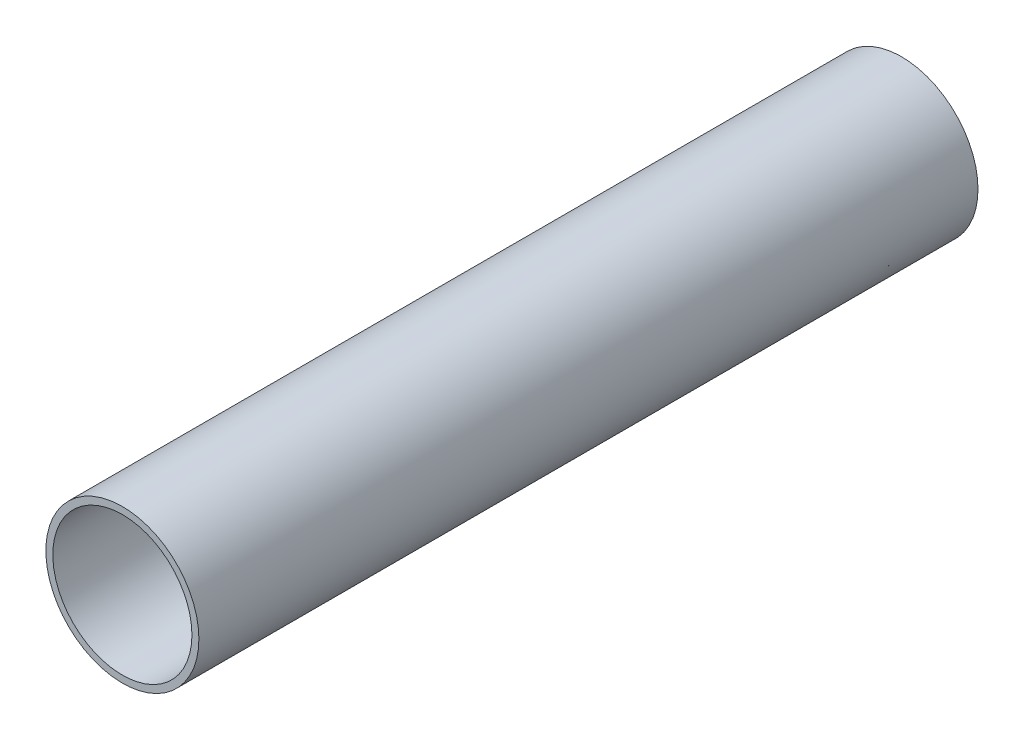
ISO-10303-21;
HEADER;
FILE_DESCRIPTION(('STEP AP214'),'2;1');
FILE_NAME('part.step','',(''),(''),'','','');
FILE_SCHEMA(('AUTOMOTIVE_DESIGN { 1 0 10303 214 1 1 1 1 }'));
ENDSEC;
DATA;
#1=APPLICATION_CONTEXT('core data for automotive mechanical design processes');
#2=APPLICATION_PROTOCOL_DEFINITION('international standard','automotive_design',2000,#1);
#3=PRODUCT_CONTEXT('',#1,'mechanical');
#4=PRODUCT('Part','Part','',(#3));
#5=PRODUCT_RELATED_PRODUCT_CATEGORY('part','',(#4));
#6=PRODUCT_DEFINITION_FORMATION('','',#4);
#7=PRODUCT_DEFINITION_CONTEXT('part definition',#1,'design');
#8=PRODUCT_DEFINITION('design','',#6,#7);
#9=PRODUCT_DEFINITION_SHAPE('','',#8);
#10=(LENGTH_UNIT() NAMED_UNIT(*) SI_UNIT(.MILLI.,.METRE.));
#11=(NAMED_UNIT(*) PLANE_ANGLE_UNIT() SI_UNIT($,.RADIAN.));
#12=(NAMED_UNIT(*) SI_UNIT($,.STERADIAN.) SOLID_ANGLE_UNIT());
#13=UNCERTAINTY_MEASURE_WITH_UNIT(LENGTH_MEASURE(1.E-05),#10,'distance_accuracy_value','');
#14=(GEOMETRIC_REPRESENTATION_CONTEXT(3) GLOBAL_UNCERTAINTY_ASSIGNED_CONTEXT((#13)) GLOBAL_UNIT_ASSIGNED_CONTEXT((#10,
#11,#12)) REPRESENTATION_CONTEXT('',''));
#15=CARTESIAN_POINT('',(0.,0.,0.));
#16=DIRECTION('',(0.,0.,1.));
#17=DIRECTION('',(1.,0.,0.));
#18=AXIS2_PLACEMENT_3D('',#15,#16,#17);
#19=CARTESIAN_POINT('',(0.,0.,28.));
#20=DIRECTION('',(0.,0.,1.));
#21=DIRECTION('',(1.,0.,0.));
#22=AXIS2_PLACEMENT_3D('',#19,#20,#21);
#23=PLANE('',#22);
#24=CARTESIAN_POINT('',(0.,0.,28.));
#25=DIRECTION('',(0.,0.,1.));
#26=DIRECTION('',(1.,0.,0.));
#27=AXIS2_PLACEMENT_3D('',#24,#25,#26);
#28=CIRCLE('',#27,5.5);
#29=CARTESIAN_POINT('',(5.5,0.,28.));
#30=VERTEX_POINT('',#29);
#31=EDGE_CURVE('E79',#30,#30,#28,.T.);
#32=ORIENTED_EDGE('',*,*,#31,.T.);
#33=EDGE_LOOP('',(#32));
#34=FACE_BOUND('',#33,.T.);
#35=CARTESIAN_POINT('',(0.,0.,28.));
#36=DIRECTION('',(0.,0.,1.));
#37=DIRECTION('',(1.,0.,0.));
#38=AXIS2_PLACEMENT_3D('',#35,#36,#37);
#39=CIRCLE('',#38,5.);
#40=CARTESIAN_POINT('',(5.,0.,28.));
#41=VERTEX_POINT('',#40);
#42=EDGE_CURVE('E69',#41,#41,#39,.T.);
#43=ORIENTED_EDGE('',*,*,#42,.F.);
#44=EDGE_LOOP('',(#43));
#45=FACE_BOUND('',#44,.T.);
#46=ADVANCED_FACE('F44',(#34,#45),#23,.T.);
#47=CARTESIAN_POINT('',(0.,0.,-28.));
#48=DIRECTION('',(0.,0.,1.));
#49=DIRECTION('',(1.,0.,0.));
#50=AXIS2_PLACEMENT_3D('',#47,#48,#49);
#51=PLANE('',#50);
#52=CARTESIAN_POINT('',(0.,0.,-28.));
#53=DIRECTION('',(0.,0.,1.));
#54=DIRECTION('',(1.,0.,0.));
#55=AXIS2_PLACEMENT_3D('',#52,#53,#54);
#56=CIRCLE('',#55,5.5);
#57=CARTESIAN_POINT('',(5.5,0.,-28.));
#58=VERTEX_POINT('',#57);
#59=EDGE_CURVE('E82',#58,#58,#56,.T.);
#60=ORIENTED_EDGE('',*,*,#59,.F.);
#61=EDGE_LOOP('',(#60));
#62=FACE_BOUND('',#61,.T.);
#63=CARTESIAN_POINT('',(0.,0.,-28.));
#64=DIRECTION('',(0.,0.,1.));
#65=DIRECTION('',(1.,0.,0.));
#66=AXIS2_PLACEMENT_3D('',#63,#64,#65);
#67=CIRCLE('',#66,5.);
#68=CARTESIAN_POINT('',(0.,5.,-28.));
#69=VERTEX_POINT('',#68);
#70=CARTESIAN_POINT('',(0.,-5.,-28.));
#71=VERTEX_POINT('',#70);
#72=EDGE_CURVE('E63',#69,#71,#67,.T.);
#73=ORIENTED_EDGE('',*,*,#72,.T.);
#74=EDGE_CURVE('E68',#71,#69,#67,.T.);
#75=ORIENTED_EDGE('',*,*,#74,.T.);
#76=EDGE_LOOP('',(#73,#75));
#77=FACE_BOUND('',#76,.T.);
#78=ADVANCED_FACE('F67',(#62,#77),#51,.F.);
#79=CARTESIAN_POINT('',(0.,0.,28.));
#80=DIRECTION('',(0.,0.,-1.));
#81=DIRECTION('',(-1.,0.,0.));
#82=AXIS2_PLACEMENT_3D('',#79,#80,#81);
#83=CYLINDRICAL_SURFACE('',#82,5.5);
#84=ORIENTED_EDGE('',*,*,#31,.F.);
#85=EDGE_LOOP('',(#84));
#86=FACE_BOUND('',#85,.T.);
#87=ORIENTED_EDGE('',*,*,#59,.T.);
#88=EDGE_LOOP('',(#87));
#89=FACE_BOUND('',#88,.T.);
#90=ADVANCED_FACE('F46',(#86,#89),#83,.T.);
#91=CARTESIAN_POINT('',(0.,0.,28.));
#92=DIRECTION('',(0.,0.,-1.));
#93=DIRECTION('',(-1.,0.,0.));
#94=AXIS2_PLACEMENT_3D('',#91,#92,#93);
#95=CYLINDRICAL_SURFACE('',#94,5.);
#96=CARTESIAN_POINT('',(0.,-5.,20.5));
#97=CARTESIAN_POINT('',(0.055576906791677,-4.99999897580871,20.4999979555017));
#98=CARTESIAN_POINT('',(0.11117966019961,-4.99906385178234,20.4953511570325));
#99=CARTESIAN_POINT('',(0.220813507685275,-4.99542365623247,20.4769014998856));
#100=CARTESIAN_POINT('',(0.274843317536735,-4.99271717860211,20.4630913671998));
#101=CARTESIAN_POINT('',(0.379730305257039,-4.98583649278334,20.4267587263817));
#102=CARTESIAN_POINT('',(0.430590467926088,-4.98166369076778,20.4042445631586));
#103=CARTESIAN_POINT('',(0.527807988855865,-4.97230398035402,20.3511677524938));
#104=CARTESIAN_POINT('',(0.574165615066911,-4.9671171323581,20.320605584399));
#105=CARTESIAN_POINT('',(0.661693477305396,-4.95622165330096,20.2518615057168));
#106=CARTESIAN_POINT('',(0.702793951149001,-4.95050745504483,20.2135916446181));
#107=CARTESIAN_POINT('',(0.778036756598671,-4.93924180452736,20.1307075836198));
#108=CARTESIAN_POINT('',(0.812178544761286,-4.93369036500574,20.0860928886775));
#109=CARTESIAN_POINT('',(0.872831753339674,-4.92332441812757,19.9912838070023));
#110=CARTESIAN_POINT('',(0.899270938858775,-4.91851707365076,19.9410423562181));
#111=CARTESIAN_POINT('',(0.943305666574963,-4.91026268058521,19.8367181810109));
#112=CARTESIAN_POINT('',(0.960902082432783,-4.90681549762049,19.7826358366688));
#113=CARTESIAN_POINT('',(0.986525299882335,-4.90172805252255,19.6729156361066));
#114=CARTESIAN_POINT('',(0.994674497957217,-4.90006470107219,19.6173074558715));
#115=CARTESIAN_POINT('',(1.00155212772611,-4.89866375060627,19.5054901786475));
#116=CARTESIAN_POINT('',(1.00028152271411,-4.89892595467828,19.4492811436907));
#117=CARTESIAN_POINT('',(0.988454573103269,-4.90132551148155,19.3387532119874));
#118=CARTESIAN_POINT('',(0.978038540245526,-4.90343452858731,19.2844185943797));
#119=CARTESIAN_POINT('',(0.948437884624575,-4.90924546159972,19.1782839233413));
#120=CARTESIAN_POINT('',(0.92925284310194,-4.91294745357755,19.1264839910839));
#121=CARTESIAN_POINT('',(0.882524783675131,-4.92155618500401,19.026484738297));
#122=CARTESIAN_POINT('',(0.854926151231974,-4.92647089813707,18.9783121204305));
#123=CARTESIAN_POINT('',(0.792193574571142,-4.93694618773087,18.8872291500251));
#124=CARTESIAN_POINT('',(0.757058764354448,-4.94250683838403,18.844319403146));
#125=CARTESIAN_POINT('',(0.679499934556729,-4.95377021241515,18.7641705975395));
#126=CARTESIAN_POINT('',(0.636956161208037,-4.95947369210962,18.7270474321372));
#127=CARTESIAN_POINT('',(0.546185024056451,-4.9702884871447,18.6604461536951));
#128=CARTESIAN_POINT('',(0.497957587373233,-4.97539979489036,18.6309681387029));
#129=CARTESIAN_POINT('',(0.397059386872352,-4.98446690160939,18.5804724907712));
#130=CARTESIAN_POINT('',(0.344381819578984,-4.98842088848315,18.5594681063532));
#131=CARTESIAN_POINT('',(0.236148976442955,-4.99471408987885,18.5266395259601));
#132=CARTESIAN_POINT('',(0.180594050067095,-4.9970535000055,18.5148142179254));
#133=CARTESIAN_POINT('',(0.069179405623226,-4.99982671866872,18.5008435462055));
#134=CARTESIAN_POINT('',(0.0133403283227408,-5.0002917465247,18.4985395804597));
#135=CARTESIAN_POINT('',(-0.0979249341933693,-4.999350519301,18.5032498589423));
#136=CARTESIAN_POINT('',(-0.153351142443357,-4.99794436941446,18.5102635793526));
#137=CARTESIAN_POINT('',(-0.261705659943856,-4.9934383200803,18.5332783735433));
#138=CARTESIAN_POINT('',(-0.314651948336066,-4.9903537640423,18.5491980684967));
#139=CARTESIAN_POINT('',(-0.417123627493724,-4.98283552061081,18.5894839826532));
#140=CARTESIAN_POINT('',(-0.466648761630642,-4.97840173214291,18.6138508346733));
#141=CARTESIAN_POINT('',(-0.561541173677942,-4.96859911533387,18.6706824906458));
#142=CARTESIAN_POINT('',(-0.606850126743466,-4.96321950437158,18.7032427810324));
#143=CARTESIAN_POINT('',(-0.691418019109883,-4.95214734830012,18.7754091911985));
#144=CARTESIAN_POINT('',(-0.730676308921283,-4.94645476968528,18.8150160663898));
#145=CARTESIAN_POINT('',(-0.80264059076518,-4.93529303557112,18.9008733518791));
#146=CARTESIAN_POINT('',(-0.83523770244021,-4.92982860233448,18.9472157442086));
#147=CARTESIAN_POINT('',(-0.892185420044018,-4.91984191796325,19.0448113613426));
#148=CARTESIAN_POINT('',(-0.91653635591642,-4.91531962913464,19.0960643895589));
#149=CARTESIAN_POINT('',(-0.956151841577343,-4.90776740584473,19.2017682461346));
#150=CARTESIAN_POINT('',(-0.971463499787446,-4.90472974872258,19.2562008411958));
#151=CARTESIAN_POINT('',(-0.992708651625426,-4.90047436792061,19.3669334534774));
#152=CARTESIAN_POINT('',(-0.998643368224163,-4.89925640691131,19.4232332261965));
#153=CARTESIAN_POINT('',(-1.00092091086792,-4.8987914963137,19.5350088645334));
#154=CARTESIAN_POINT('',(-0.99743578807184,-4.89950919189282,19.5904811489174));
#155=CARTESIAN_POINT('',(-0.981352304101556,-4.90275573484584,19.700031649898));
#156=CARTESIAN_POINT('',(-0.968754016130856,-4.90528456767138,19.7541098776892));
#157=CARTESIAN_POINT('',(-0.934878568500219,-4.91185264219135,19.8592277112375));
#158=CARTESIAN_POINT('',(-0.913622506718257,-4.91588821018814,19.9102743605006));
#159=CARTESIAN_POINT('',(-0.863054644601445,-4.92501714974173,20.0081037207348));
#160=CARTESIAN_POINT('',(-0.833742168774004,-4.93011060998909,20.0548860737266));
#161=CARTESIAN_POINT('',(-0.767305914784078,-4.94088960523262,20.1437155721532));
#162=CARTESIAN_POINT('',(-0.73005788723217,-4.94658372909745,20.1856687652709));
#163=CARTESIAN_POINT('',(-0.649064369008643,-4.95786081872014,20.2627862055331));
#164=CARTESIAN_POINT('',(-0.605317387148024,-4.9634437586325,20.2979488903214));
#165=CARTESIAN_POINT('',(-0.512017629081917,-4.97393832388037,20.3608346439502));
#166=CARTESIAN_POINT('',(-0.462408884423381,-4.97884231219306,20.3884760032834));
#167=CARTESIAN_POINT('',(-0.359166360934104,-4.98735125085048,20.4349861225991));
#168=CARTESIAN_POINT('',(-0.305536260856448,-4.99095737138657,20.4538627895346));
#169=CARTESIAN_POINT('',(-0.20982148891813,-4.99576372595393,20.4786519480459));
#170=CARTESIAN_POINT('',(-0.16828166400923,-4.99734303158466,20.4866431937085));
#171=CARTESIAN_POINT('',(-0.0844995252077601,-4.99946154139896,20.4973179123585));
#172=CARTESIAN_POINT('',(-0.0422572337474654,-5.00000077873155,20.5000015545098));
#173=CARTESIAN_POINT('',(0.,-5.,20.5));
#174=B_SPLINE_CURVE_WITH_KNOTS('',3,(#96,#97,#98,#99,#100,#101,#102,#103,#104,#105,#106,#107,
#108,#109,#110,#111,#112,#113,#114,#115,#116,#117,#118,#119,#120,#121,#122,#123,#124,#125,#126,
#127,#128,#129,#130,#131,#132,#133,#134,#135,#136,#137,#138,#139,#140,#141,#142,#143,#144,#145,
#146,#147,#148,#149,#150,#151,#152,#153,#154,#155,#156,#157,#158,#159,#160,#161,#162,#163,#164,
#165,#166,#167,#168,#169,#170,#171,#172,#173),.UNSPECIFIED.,.T.,.F.,(4,2,2,2,2,2,2,2,2,2,2,2,2,
2,2,2,2,2,2,2,2,2,2,2,2,2,2,2,2,2,2,2,2,2,2,2,2,2,4),(0.,0.166576130658399,0.333284650685602,
0.499833735241564,0.666372902219031,0.834932670098119,1.00350559673107,1.17361195004325,
1.34370149363633,1.51156185102314,1.67940504280243,1.84471727005694,2.01003739253544,
2.17647490203741,2.34293154750153,2.51238252491971,2.68183567540576,2.85155274854652,
3.02124925698535,3.1881073567644,3.35495607657718,3.52030453950199,3.68566539215124,
3.85305066032172,4.02045388344454,4.19040628577675,4.36035188721842,4.52940381031303,
4.69843368329199,4.86439722566865,5.03035943492152,5.19591961253029,5.36149367582162,
5.52988076239664,5.69830654533676,5.86849496676356,6.03852955518209,6.1651877529024,
6.29184191370997),.UNSPECIFIED.);
#175=CARTESIAN_POINT('',(0.,-5.,20.5));
#176=VERTEX_POINT('',#175);
#177=EDGE_CURVE('E13',#176,#176,#174,.T.);
#178=ORIENTED_EDGE('',*,*,#177,.F.);
#179=EDGE_LOOP('',(#178));
#180=FACE_BOUND('',#179,.T.);
#181=CARTESIAN_POINT('',(0.,5.,20.5));
#182=CARTESIAN_POINT('',(-0.0555769067935894,4.99999897580871,20.4999979555017));
#183=CARTESIAN_POINT('',(-0.111179660203435,4.99906385178228,20.4953511570322));
#184=CARTESIAN_POINT('',(-0.220813507692764,4.99542365623216,20.476901499884));
#185=CARTESIAN_POINT('',(-0.274843317545977,4.99271717860162,20.4630913671972));
#186=CARTESIAN_POINT('',(-0.379730305269587,4.9858364927824,20.4267587263767));
#187=CARTESIAN_POINT('',(-0.430590467940182,4.98166369076658,20.404244563152));
#188=CARTESIAN_POINT('',(-0.527807988872589,4.97230398035226,20.3511677524836));
#189=CARTESIAN_POINT('',(-0.574165615084716,4.96711713235604,20.3206055843866));
#190=CARTESIAN_POINT('',(-0.661693477324337,4.95622165329844,20.2518615057003));
#191=CARTESIAN_POINT('',(-0.70279395116805,4.95050745504212,20.2135916445995));
#192=CARTESIAN_POINT('',(-0.778036756617388,4.93924180452441,20.1307075835968));
#193=CARTESIAN_POINT('',(-0.812178544779566,4.93369036500273,20.0860928886523));
#194=CARTESIAN_POINT('',(-0.87283175335557,4.92332441812474,19.991283806974));
#195=CARTESIAN_POINT('',(-0.899270938872962,4.91851707364816,19.9410423561892));
#196=CARTESIAN_POINT('',(-0.943305666585658,4.91026268058315,19.8367181809809));
#197=CARTESIAN_POINT('',(-0.960902082441697,4.90681549761874,19.7826358366385));
#198=CARTESIAN_POINT('',(-0.986525299887324,4.90172805252154,19.6729156360775));
#199=CARTESIAN_POINT('',(-0.994674497960343,4.90006470107156,19.6173074558441));
#200=CARTESIAN_POINT('',(-1.00155212772614,4.89866375060627,19.5054901786238));
#201=CARTESIAN_POINT('',(-1.0002815227129,4.89892595467853,19.449281143669));
#202=CARTESIAN_POINT('',(-0.988454573100374,4.90132551148214,19.3387532119706));
#203=CARTESIAN_POINT('',(-0.978038540242291,4.90343452858796,19.2844185943657));
#204=CARTESIAN_POINT('',(-0.948437884621532,4.9092454616003,19.1782839233327));
#205=CARTESIAN_POINT('',(-0.929252843099428,4.91294745357802,19.1264839910781));
#206=CARTESIAN_POINT('',(-0.882524783674314,4.92155618500415,19.0264847382958));
#207=CARTESIAN_POINT('',(-0.854926151232259,4.92647089813701,18.9783121204312));
#208=CARTESIAN_POINT('',(-0.79219357457422,4.93694618773037,18.8872291500293));
#209=CARTESIAN_POINT('',(-0.757058764359215,4.94250683838329,18.8443194031517));
#210=CARTESIAN_POINT('',(-0.679499934564445,4.95377021241408,18.7641705975467));
#211=CARTESIAN_POINT('',(-0.636956161216858,4.95947369210848,18.7270474321445));
#212=CARTESIAN_POINT('',(-0.546185024067574,4.97028848714347,18.6604461537024));
#213=CARTESIAN_POINT('',(-0.49795758738555,4.97539979488911,18.63096813871));
#214=CARTESIAN_POINT('',(-0.397059386885495,4.98446690160835,18.5804724907768));
#215=CARTESIAN_POINT('',(-0.344381819591621,4.98842088848229,18.5594681063578));
#216=CARTESIAN_POINT('',(-0.236148976454378,4.99471408987832,18.5266395259628));
#217=CARTESIAN_POINT('',(-0.180594050077807,4.99705350000512,18.5148142179273));
#218=CARTESIAN_POINT('',(-0.0691794056310762,4.99982671866863,18.5008435462059));
#219=CARTESIAN_POINT('',(-0.013340328328413,5.0002917465247,18.4985395804597));
#220=CARTESIAN_POINT('',(0.0979249341920574,4.99935051930105,18.5032498589421));
#221=CARTESIAN_POINT('',(0.153351142444227,4.99794436941446,18.5102635793526));
#222=CARTESIAN_POINT('',(0.261705659949225,4.99343832008005,18.5332783735446));
#223=CARTESIAN_POINT('',(0.31465194834374,4.99035376404183,18.5491980684991));
#224=CARTESIAN_POINT('',(0.417123627505611,4.98283552060984,18.5894839826585));
#225=CARTESIAN_POINT('',(0.466648761644438,4.97840173214163,18.6138508346804));
#226=CARTESIAN_POINT('',(0.561541173694494,4.96859911533201,18.6706824906568));
#227=CARTESIAN_POINT('',(0.606850126760911,4.96321950436945,18.7032427810455));
#228=CARTESIAN_POINT('',(0.691418019128532,4.95214734829752,18.7754091912161));
#229=CARTESIAN_POINT('',(0.730676308940243,4.94645476968248,18.8150160664099));
#230=CARTESIAN_POINT('',(0.802640590783174,4.93529303556818,18.9008733519031));
#231=CARTESIAN_POINT('',(0.835237702457102,4.92982860233161,18.9472157442341));
#232=CARTESIAN_POINT('',(0.892185420058397,4.91984191796063,19.0448113613707));
#233=CARTESIAN_POINT('',(0.916536355929389,4.91531962913221,19.0960643895882));
#234=CARTESIAN_POINT('',(0.956151841586583,4.90776740584292,19.2017682461645));
#235=CARTESIAN_POINT('',(0.97146349979466,4.90472974872115,19.2562008412248));
#236=CARTESIAN_POINT('',(0.992708651628971,4.90047436791989,19.3669334535044));
#237=CARTESIAN_POINT('',(0.998643368226066,4.89925640691092,19.4232332262222));
#238=CARTESIAN_POINT('',(1.00092091086702,4.89879149631388,19.5350088645553));
#239=CARTESIAN_POINT('',(0.997435788069957,4.8995091918932,19.5904811489366));
#240=CARTESIAN_POINT('',(0.981352304098571,4.90275573484644,19.700031649912));
#241=CARTESIAN_POINT('',(0.968754016127747,4.905284567672,19.7541098777005));
#242=CARTESIAN_POINT('',(0.934878568497695,4.91185264219183,19.8592277112436));
#243=CARTESIAN_POINT('',(0.913622506716436,4.91588821018847,19.9102743605043));
#244=CARTESIAN_POINT('',(0.863054644601768,4.92501714974167,20.008103720734));
#245=CARTESIAN_POINT('',(0.833742168775767,4.93011060998878,20.0548860737237));
#246=CARTESIAN_POINT('',(0.767305914788757,4.94088960523189,20.1437155721475));
#247=CARTESIAN_POINT('',(0.730057887238196,4.94658372909654,20.1856687652643));
#248=CARTESIAN_POINT('',(0.649064369017643,4.95786081871895,20.2627862055253));
#249=CARTESIAN_POINT('',(0.605317387158651,4.96344375863119,20.2979488903132));
#250=CARTESIAN_POINT('',(0.512017629094579,4.97393832387906,20.3608346439427));
#251=CARTESIAN_POINT('',(0.462408884436291,4.97884231219186,20.3884760032767));
#252=CARTESIAN_POINT('',(0.359166360947363,4.98735125084952,20.434986122594));
#253=CARTESIAN_POINT('',(0.305536260869807,4.99095737138575,20.4538627895304));
#254=CARTESIAN_POINT('',(0.209821488929432,4.99576372595348,20.4786519480436));
#255=CARTESIAN_POINT('',(0.168281664018341,4.99734303158437,20.486643193707));
#256=CARTESIAN_POINT('',(0.0844995252123744,4.9994615413989,20.4973179123582));
#257=CARTESIAN_POINT('',(0.042257233749773,5.00000077873155,20.5000015545098));
#258=CARTESIAN_POINT('',(0.,5.,20.5));
#259=B_SPLINE_CURVE_WITH_KNOTS('',3,(#181,#182,#183,#184,#185,#186,#187,#188,#189,#190,#191,
#192,#193,#194,#195,#196,#197,#198,#199,#200,#201,#202,#203,#204,#205,#206,#207,#208,#209,#210,
#211,#212,#213,#214,#215,#216,#217,#218,#219,#220,#221,#222,#223,#224,#225,#226,#227,#228,#229,
#230,#231,#232,#233,#234,#235,#236,#237,#238,#239,#240,#241,#242,#243,#244,#245,#246,#247,#248,
#249,#250,#251,#252,#253,#254,#255,#256,#257,#258),.UNSPECIFIED.,.T.,.F.,(4,2,2,2,2,2,2,2,2,2,2,
2,2,2,2,2,2,2,2,2,2,2,2,2,2,2,2,2,2,2,2,2,2,2,2,2,2,2,4),(0.,0.166576130664118,
0.333284650697046,0.499833735259121,0.666372902242699,0.834932670126257,1.00350559676366,
1.17361195007521,1.34370149366763,1.51156185104862,1.67940504282208,1.84471727006863,
2.01003739253916,2.17647490203445,2.34293154749189,2.51238252490732,2.68183567539065,
2.85155274853397,3.02124925697538,3.18810735676092,3.35495607658019,3.52030453951249,
3.68566539216922,3.85305066034547,4.02045388347407,4.19040628580778,4.36035188725093,
4.52940381034146,4.69843368331633,4.8643972256854,5.03035943493068,5.19591961253193,
5.36149367581574,5.52988076238625,5.69830654532188,5.86849496674921,6.03852955516831,
6.16518775289551,6.29184191370999),.UNSPECIFIED.);
#260=CARTESIAN_POINT('',(0.,5.,20.5));
#261=VERTEX_POINT('',#260);
#262=EDGE_CURVE('E56',#261,#261,#259,.T.);
#263=ORIENTED_EDGE('',*,*,#262,.F.);
#264=EDGE_LOOP('',(#263));
#265=FACE_BOUND('',#264,.T.);
#266=ORIENTED_EDGE('',*,*,#42,.T.);
#267=EDGE_LOOP('',(#266));
#268=FACE_BOUND('',#267,.T.);
#269=ORIENTED_EDGE('',*,*,#74,.F.);
#270=CARTESIAN_POINT('',(0.,-5.,-26.));
#271=CARTESIAN_POINT('',(-0.055576906791677,-4.99999897580871,-26.0000020444983));
#272=CARTESIAN_POINT('',(-0.11117966019961,-4.99906385178234,-26.0046488429675));
#273=CARTESIAN_POINT('',(-0.220813507685274,-4.99542365623247,-26.0230985001144));
#274=CARTESIAN_POINT('',(-0.274843317536735,-4.99271717860211,-26.0369086328002));
#275=CARTESIAN_POINT('',(-0.37973030525704,-4.98583649278334,-26.0732412736183));
#276=CARTESIAN_POINT('',(-0.430590467926088,-4.98166369076778,-26.0957554368414));
#277=CARTESIAN_POINT('',(-0.527807988855865,-4.97230398035402,-26.1488322475062));
#278=CARTESIAN_POINT('',(-0.57416561506691,-4.9671171323581,-26.179394415601));
#279=CARTESIAN_POINT('',(-0.661693477305395,-4.95622165330096,-26.2481384942832));
#280=CARTESIAN_POINT('',(-0.702793951149,-4.95050745504483,-26.2864083553819));
#281=CARTESIAN_POINT('',(-0.77803675659867,-4.93924180452736,-26.3692924163802));
#282=CARTESIAN_POINT('',(-0.812178544761286,-4.93369036500574,-26.4139071113225));
#283=CARTESIAN_POINT('',(-0.872831753339674,-4.92332441812757,-26.5087161929977));
#284=CARTESIAN_POINT('',(-0.899270938858774,-4.91851707365076,-26.5589576437819));
#285=CARTESIAN_POINT('',(-0.943305666574962,-4.91026268058521,-26.6632818189891));
#286=CARTESIAN_POINT('',(-0.960902082432782,-4.90681549762049,-26.7173641633312));
#287=CARTESIAN_POINT('',(-0.986525299882334,-4.90172805252255,-26.8270843638934));
#288=CARTESIAN_POINT('',(-0.994674497957216,-4.90006470107219,-26.8826925441285));
#289=CARTESIAN_POINT('',(-1.00155212772611,-4.89866375060627,-26.9945098213525));
#290=CARTESIAN_POINT('',(-1.00028152271411,-4.89892595467828,-27.0507188563093));
#291=CARTESIAN_POINT('',(-0.988454573103268,-4.90132551148155,-27.1612467880126));
#292=CARTESIAN_POINT('',(-0.978038540245525,-4.90343452858731,-27.2155814056203));
#293=CARTESIAN_POINT('',(-0.948437884624574,-4.90924546159972,-27.3217160766587));
#294=CARTESIAN_POINT('',(-0.929252843101939,-4.91294745357755,-27.3735160089161));
#295=CARTESIAN_POINT('',(-0.882524783675131,-4.92155618500401,-27.473515261703));
#296=CARTESIAN_POINT('',(-0.854926151231975,-4.92647089813708,-27.5216878795695));
#297=CARTESIAN_POINT('',(-0.792193574571143,-4.93694618773087,-27.6127708499749));
#298=CARTESIAN_POINT('',(-0.757058764354447,-4.94250683838403,-27.655680596854));
#299=CARTESIAN_POINT('',(-0.679499934556728,-4.95377021241515,-27.7358294024605));
#300=CARTESIAN_POINT('',(-0.636956161208038,-4.95947369210962,-27.7729525678628));
#301=CARTESIAN_POINT('',(-0.546185024056453,-4.9702884871447,-27.8395538463049));
#302=CARTESIAN_POINT('',(-0.497957587373233,-4.97539979489036,-27.8690318612971));
#303=CARTESIAN_POINT('',(-0.397059386872351,-4.98446690160939,-27.9195275092288));
#304=CARTESIAN_POINT('',(-0.344381819578983,-4.98842088848315,-27.9405318936468));
#305=CARTESIAN_POINT('',(-0.236148976442956,-4.99471408987885,-27.9733604740399));
#306=CARTESIAN_POINT('',(-0.180594050067095,-4.9970535000055,-27.9851857820746));
#307=CARTESIAN_POINT('',(-0.0691794056232273,-4.99982671866872,-27.9991564537945));
#308=CARTESIAN_POINT('',(-0.013340328322742,-5.00029174652469,-28.0014604195403));
#309=CARTESIAN_POINT('',(0.0979249341933687,-4.999350519301,-27.9967501410577));
#310=CARTESIAN_POINT('',(0.153351142443357,-4.99794436941446,-27.9897364206474));
#311=CARTESIAN_POINT('',(0.261705659943856,-4.9934383200803,-27.9667216264567));
#312=CARTESIAN_POINT('',(0.314651948336066,-4.9903537640423,-27.9508019315033));
#313=CARTESIAN_POINT('',(0.417123627493724,-4.98283552061081,-27.9105160173468));
#314=CARTESIAN_POINT('',(0.466648761630642,-4.97840173214291,-27.8861491653267));
#315=CARTESIAN_POINT('',(0.561541173677943,-4.96859911533387,-27.8293175093542));
#316=CARTESIAN_POINT('',(0.606850126743467,-4.96321950437158,-27.7967572189676));
#317=CARTESIAN_POINT('',(0.691418019109884,-4.95214734830012,-27.7245908088015));
#318=CARTESIAN_POINT('',(0.730676308921283,-4.94645476968528,-27.6849839336102));
#319=CARTESIAN_POINT('',(0.80264059076518,-4.93529303557112,-27.5991266481209));
#320=CARTESIAN_POINT('',(0.83523770244021,-4.92982860233448,-27.5527842557914));
#321=CARTESIAN_POINT('',(0.892185420044018,-4.91984191796325,-27.4551886386574));
#322=CARTESIAN_POINT('',(0.916536355916421,-4.91531962913464,-27.4039356104411));
#323=CARTESIAN_POINT('',(0.956151841577342,-4.90776740584473,-27.2982317538654));
#324=CARTESIAN_POINT('',(0.971463499787445,-4.90472974872258,-27.2437991588042));
#325=CARTESIAN_POINT('',(0.992708651625425,-4.90047436792061,-27.1330665465226));
#326=CARTESIAN_POINT('',(0.998643368224163,-4.89925640691131,-27.0767667738035));
#327=CARTESIAN_POINT('',(1.00092091086792,-4.8987914963137,-26.9649911354666));
#328=CARTESIAN_POINT('',(0.997435788071839,-4.89950919189282,-26.9095188510826));
#329=CARTESIAN_POINT('',(0.981352304101555,-4.90275573484584,-26.799968350102));
#330=CARTESIAN_POINT('',(0.968754016130855,-4.90528456767138,-26.7458901223108));
#331=CARTESIAN_POINT('',(0.934878568500218,-4.91185264219135,-26.6407722887625));
#332=CARTESIAN_POINT('',(0.913622506718256,-4.91588821018814,-26.5897256394994));
#333=CARTESIAN_POINT('',(0.863054644601444,-4.92501714974173,-26.4918962792652));
#334=CARTESIAN_POINT('',(0.833742168774003,-4.93011060998909,-26.4451139262734));
#335=CARTESIAN_POINT('',(0.767305914784077,-4.94088960523262,-26.3562844278468));
#336=CARTESIAN_POINT('',(0.730057887232169,-4.94658372909745,-26.3143312347291));
#337=CARTESIAN_POINT('',(0.649064369008642,-4.95786081872014,-26.2372137944669));
#338=CARTESIAN_POINT('',(0.605317387148022,-4.9634437586325,-26.2020511096786));
#339=CARTESIAN_POINT('',(0.512017629081915,-4.97393832388037,-26.1391653560498));
#340=CARTESIAN_POINT('',(0.462408884423379,-4.97884231219306,-26.1115239967166));
#341=CARTESIAN_POINT('',(0.359166360934103,-4.98735125085048,-26.0650138774009));
#342=CARTESIAN_POINT('',(0.305536260856447,-4.99095737138657,-26.0461372104654));
#343=CARTESIAN_POINT('',(0.20982148891813,-4.99576372595393,-26.0213480519541));
#344=CARTESIAN_POINT('',(0.168281664009231,-4.99734303158466,-26.0133568062915));
#345=CARTESIAN_POINT('',(0.0844995252077609,-4.99946154139896,-26.0026820876415));
#346=CARTESIAN_POINT('',(0.0422572337474657,-5.00000077873155,-25.9999984454902));
#347=CARTESIAN_POINT('',(0.,-5.,-26.));
#348=B_SPLINE_CURVE_WITH_KNOTS('',3,(#270,#271,#272,#273,#274,#275,#276,#277,#278,#279,#280,
#281,#282,#283,#284,#285,#286,#287,#288,#289,#290,#291,#292,#293,#294,#295,#296,#297,#298,#299,
#300,#301,#302,#303,#304,#305,#306,#307,#308,#309,#310,#311,#312,#313,#314,#315,#316,#317,#318,
#319,#320,#321,#322,#323,#324,#325,#326,#327,#328,#329,#330,#331,#332,#333,#334,#335,#336,#337,
#338,#339,#340,#341,#342,#343,#344,#345,#346,#347),.UNSPECIFIED.,.T.,.F.,(4,2,2,2,2,2,2,2,2,2,2,
2,2,2,2,2,2,2,2,2,2,2,2,2,2,2,2,2,2,2,2,2,2,2,2,2,2,2,4),(0.,0.166576130658399,
0.333284650685601,0.499833735241565,0.666372902219029,0.834932670098117,1.00350559673107,
1.17361195004325,1.34370149363633,1.51156185102314,1.67940504280243,1.84471727005694,
2.01003739253544,2.17647490203741,2.34293154750152,2.5123825249197,2.68183567540576,
2.85155274854652,3.02124925698535,3.1881073567644,3.35495607657717,3.52030453950199,
3.68566539215124,3.85305066032171,4.02045388344454,4.19040628577675,4.36035188721842,
4.52940381031302,4.69843368329198,4.86439722566864,5.03035943492151,5.19591961253029,
5.36149367582161,5.52988076239664,5.69830654533676,5.86849496676355,6.03852955518209,
6.16518775290239,6.29184191370996),.UNSPECIFIED.);
#349=EDGE_CURVE('E73',#71,#71,#348,.T.);
#350=ORIENTED_EDGE('',*,*,#349,.T.);
#351=ORIENTED_EDGE('',*,*,#72,.F.);
#352=CARTESIAN_POINT('',(0.,5.,-28.));
#353=CARTESIAN_POINT('',(0.055576906791677,4.99999897580871,-27.9999979555017));
#354=CARTESIAN_POINT('',(0.11117966019961,4.99906385178234,-27.9953511570325));
#355=CARTESIAN_POINT('',(0.220813507685274,4.99542365623247,-27.9769014998856));
#356=CARTESIAN_POINT('',(0.274843317536735,4.99271717860211,-27.9630913671998));
#357=CARTESIAN_POINT('',(0.379730305257039,4.98583649278334,-27.9267587263817));
#358=CARTESIAN_POINT('',(0.430590467926087,4.98166369076778,-27.9042445631586));
#359=CARTESIAN_POINT('',(0.527807988855864,4.97230398035402,-27.8511677524938));
#360=CARTESIAN_POINT('',(0.57416561506691,4.9671171323581,-27.820605584399));
#361=CARTESIAN_POINT('',(0.661693477305395,4.95622165330096,-27.7518615057168));
#362=CARTESIAN_POINT('',(0.702793951149,4.95050745504483,-27.7135916446181));
#363=CARTESIAN_POINT('',(0.77803675659867,4.93924180452736,-27.6307075836198));
#364=CARTESIAN_POINT('',(0.812178544761286,4.93369036500574,-27.5860928886775));
#365=CARTESIAN_POINT('',(0.872831753339674,4.92332441812757,-27.4912838070023));
#366=CARTESIAN_POINT('',(0.899270938858774,4.91851707365076,-27.4410423562181));
#367=CARTESIAN_POINT('',(0.943305666574962,4.91026268058521,-27.3367181810109));
#368=CARTESIAN_POINT('',(0.960902082432782,4.90681549762049,-27.2826358366688));
#369=CARTESIAN_POINT('',(0.986525299882334,4.90172805252255,-27.1729156361066));
#370=CARTESIAN_POINT('',(0.994674497957216,4.90006470107219,-27.1173074558715));
#371=CARTESIAN_POINT('',(1.00155212772611,4.89866375060627,-27.0054901786475));
#372=CARTESIAN_POINT('',(1.00028152271411,4.89892595467828,-26.9492811436907));
#373=CARTESIAN_POINT('',(0.988454573103268,4.90132551148155,-26.8387532119874));
#374=CARTESIAN_POINT('',(0.978038540245525,4.90343452858731,-26.7844185943797));
#375=CARTESIAN_POINT('',(0.948437884624574,4.90924546159972,-26.6782839233413));
#376=CARTESIAN_POINT('',(0.929252843101939,4.91294745357755,-26.6264839910839));
#377=CARTESIAN_POINT('',(0.882524783675131,4.92155618500401,-26.526484738297));
#378=CARTESIAN_POINT('',(0.854926151231975,4.92647089813707,-26.4783121204305));
#379=CARTESIAN_POINT('',(0.792193574571143,4.93694618773087,-26.3872291500251));
#380=CARTESIAN_POINT('',(0.757058764354448,4.94250683838403,-26.344319403146));
#381=CARTESIAN_POINT('',(0.679499934556728,4.95377021241515,-26.2641705975395));
#382=CARTESIAN_POINT('',(0.636956161208036,4.95947369210962,-26.2270474321372));
#383=CARTESIAN_POINT('',(0.546185024056451,4.9702884871447,-26.1604461536951));
#384=CARTESIAN_POINT('',(0.497957587373233,4.97539979489036,-26.1309681387029));
#385=CARTESIAN_POINT('',(0.397059386872351,4.98446690160939,-26.0804724907712));
#386=CARTESIAN_POINT('',(0.344381819578983,4.98842088848315,-26.0594681063532));
#387=CARTESIAN_POINT('',(0.236148976442956,4.99471408987885,-26.0266395259601));
#388=CARTESIAN_POINT('',(0.180594050067095,4.9970535000055,-26.0148142179254));
#389=CARTESIAN_POINT('',(0.0691794056232273,4.99982671866872,-26.0008435462055));
#390=CARTESIAN_POINT('',(0.013340328322742,5.00029174652469,-25.9985395804597));
#391=CARTESIAN_POINT('',(-0.0979249341933687,4.999350519301,-26.0032498589423));
#392=CARTESIAN_POINT('',(-0.153351142443357,4.99794436941446,-26.0102635793526));
#393=CARTESIAN_POINT('',(-0.261705659943856,4.9934383200803,-26.0332783735433));
#394=CARTESIAN_POINT('',(-0.314651948336066,4.9903537640423,-26.0491980684967));
#395=CARTESIAN_POINT('',(-0.417123627493724,4.98283552061081,-26.0894839826532));
#396=CARTESIAN_POINT('',(-0.466648761630642,4.97840173214291,-26.1138508346733));
#397=CARTESIAN_POINT('',(-0.561541173677943,4.96859911533387,-26.1706824906458));
#398=CARTESIAN_POINT('',(-0.606850126743466,4.96321950437158,-26.2032427810324));
#399=CARTESIAN_POINT('',(-0.691418019109882,4.95214734830012,-26.2754091911985));
#400=CARTESIAN_POINT('',(-0.730676308921282,4.94645476968528,-26.3150160663898));
#401=CARTESIAN_POINT('',(-0.80264059076518,4.93529303557112,-26.4008733518791));
#402=CARTESIAN_POINT('',(-0.835237702440211,4.92982860233448,-26.4472157442086));
#403=CARTESIAN_POINT('',(-0.892185420044019,4.91984191796325,-26.5448113613426));
#404=CARTESIAN_POINT('',(-0.916536355916421,4.91531962913464,-26.5960643895589));
#405=CARTESIAN_POINT('',(-0.956151841577342,4.90776740584473,-26.7017682461346));
#406=CARTESIAN_POINT('',(-0.971463499787445,4.90472974872258,-26.7562008411958));
#407=CARTESIAN_POINT('',(-0.992708651625425,4.90047436792061,-26.8669334534774));
#408=CARTESIAN_POINT('',(-0.998643368224163,4.89925640691131,-26.9232332261965));
#409=CARTESIAN_POINT('',(-1.00092091086792,4.8987914963137,-27.0350088645334));
#410=CARTESIAN_POINT('',(-0.997435788071839,4.89950919189282,-27.0904811489174));
#411=CARTESIAN_POINT('',(-0.981352304101555,4.90275573484584,-27.200031649898));
#412=CARTESIAN_POINT('',(-0.968754016130855,4.90528456767138,-27.2541098776892));
#413=CARTESIAN_POINT('',(-0.934878568500218,4.91185264219135,-27.3592277112375));
#414=CARTESIAN_POINT('',(-0.913622506718256,4.91588821018814,-27.4102743605006));
#415=CARTESIAN_POINT('',(-0.863054644601444,4.92501714974173,-27.5081037207348));
#416=CARTESIAN_POINT('',(-0.833742168774003,4.93011060998909,-27.5548860737266));
#417=CARTESIAN_POINT('',(-0.767305914784077,4.94088960523262,-27.6437155721532));
#418=CARTESIAN_POINT('',(-0.730057887232169,4.94658372909745,-27.6856687652709));
#419=CARTESIAN_POINT('',(-0.649064369008642,4.95786081872014,-27.7627862055331));
#420=CARTESIAN_POINT('',(-0.605317387148022,4.9634437586325,-27.7979488903214));
#421=CARTESIAN_POINT('',(-0.512017629081915,4.97393832388037,-27.8608346439502));
#422=CARTESIAN_POINT('',(-0.462408884423379,4.97884231219306,-27.8884760032834));
#423=CARTESIAN_POINT('',(-0.359166360934103,4.98735125085048,-27.9349861225991));
#424=CARTESIAN_POINT('',(-0.305536260856447,4.99095737138657,-27.9538627895346));
#425=CARTESIAN_POINT('',(-0.20982148891813,4.99576372595393,-27.9786519480459));
#426=CARTESIAN_POINT('',(-0.168281664009231,4.99734303158466,-27.9866431937085));
#427=CARTESIAN_POINT('',(-0.0844995252077609,4.99946154139896,-27.9973179123585));
#428=CARTESIAN_POINT('',(-0.0422572337474657,5.00000077873155,-28.0000015545098));
#429=CARTESIAN_POINT('',(0.,5.,-28.));
#430=B_SPLINE_CURVE_WITH_KNOTS('',3,(#352,#353,#354,#355,#356,#357,#358,#359,#360,#361,#362,
#363,#364,#365,#366,#367,#368,#369,#370,#371,#372,#373,#374,#375,#376,#377,#378,#379,#380,#381,
#382,#383,#384,#385,#386,#387,#388,#389,#390,#391,#392,#393,#394,#395,#396,#397,#398,#399,#400,
#401,#402,#403,#404,#405,#406,#407,#408,#409,#410,#411,#412,#413,#414,#415,#416,#417,#418,#419,
#420,#421,#422,#423,#424,#425,#426,#427,#428,#429),.UNSPECIFIED.,.T.,.F.,(4,2,2,2,2,2,2,2,2,2,2,
2,2,2,2,2,2,2,2,2,2,2,2,2,2,2,2,2,2,2,2,2,2,2,2,2,2,2,4),(0.,0.166576130658399,
0.333284650685601,0.499833735241564,0.666372902219029,0.834932670098117,1.00350559673107,
1.17361195004325,1.34370149363633,1.51156185102314,1.67940504280243,1.84471727005694,
2.01003739253544,2.17647490203741,2.34293154750152,2.5123825249197,2.68183567540576,
2.85155274854652,3.02124925698535,3.1881073567644,3.35495607657717,3.52030453950199,
3.68566539215124,3.85305066032171,4.02045388344454,4.19040628577675,4.36035188721842,
4.52940381031302,4.69843368329198,4.86439722566864,5.03035943492151,5.19591961253029,
5.36149367582161,5.52988076239664,5.69830654533676,5.86849496676355,6.03852955518209,
6.16518775290239,6.29184191370996),.UNSPECIFIED.);
#431=EDGE_CURVE('E75',#69,#69,#430,.T.);
#432=ORIENTED_EDGE('',*,*,#431,.F.);
#433=EDGE_LOOP('',(#269,#350,#351,#432));
#434=FACE_BOUND('',#433,.T.);
#435=ADVANCED_FACE('F71',(#180,#265,#268,#434),#95,.F.);
#436=CARTESIAN_POINT('',(0.,-500000.,19.5));
#437=DIRECTION('',(0.,1.,0.));
#438=DIRECTION('',(0.,0.,1.));
#439=AXIS2_PLACEMENT_3D('',#436,#437,#438);
#440=CYLINDRICAL_SURFACE('',#439,1.);
#441=ORIENTED_EDGE('',*,*,#177,.T.);
#442=EDGE_LOOP('',(#441));
#443=FACE_BOUND('',#442,.T.);
#444=ORIENTED_EDGE('',*,*,#262,.T.);
#445=EDGE_LOOP('',(#444));
#446=FACE_BOUND('',#445,.T.);
#447=ADVANCED_FACE('F89',(#443,#446),#440,.T.);
#448=CARTESIAN_POINT('',(0.,-500000.,-27.));
#449=DIRECTION('',(0.,1.,0.));
#450=DIRECTION('',(0.,0.,1.));
#451=AXIS2_PLACEMENT_3D('',#448,#449,#450);
#452=CYLINDRICAL_SURFACE('',#451,1.);
#453=ORIENTED_EDGE('',*,*,#349,.F.);
#454=EDGE_LOOP('',(#453));
#455=FACE_BOUND('',#454,.T.);
#456=ORIENTED_EDGE('',*,*,#431,.T.);
#457=EDGE_LOOP('',(#456));
#458=FACE_BOUND('',#457,.T.);
#459=ADVANCED_FACE('F93',(#455,#458),#452,.T.);
#460=CLOSED_SHELL('',(#46,#78,#90,#435,#447,#459));
#461=MANIFOLD_SOLID_BREP('B2',#460);
#462=ADVANCED_BREP_SHAPE_REPRESENTATION('',(#18,#461),#14);
#463=SHAPE_DEFINITION_REPRESENTATION(#9,#462);
ENDSEC;
END-ISO-10303-21;
